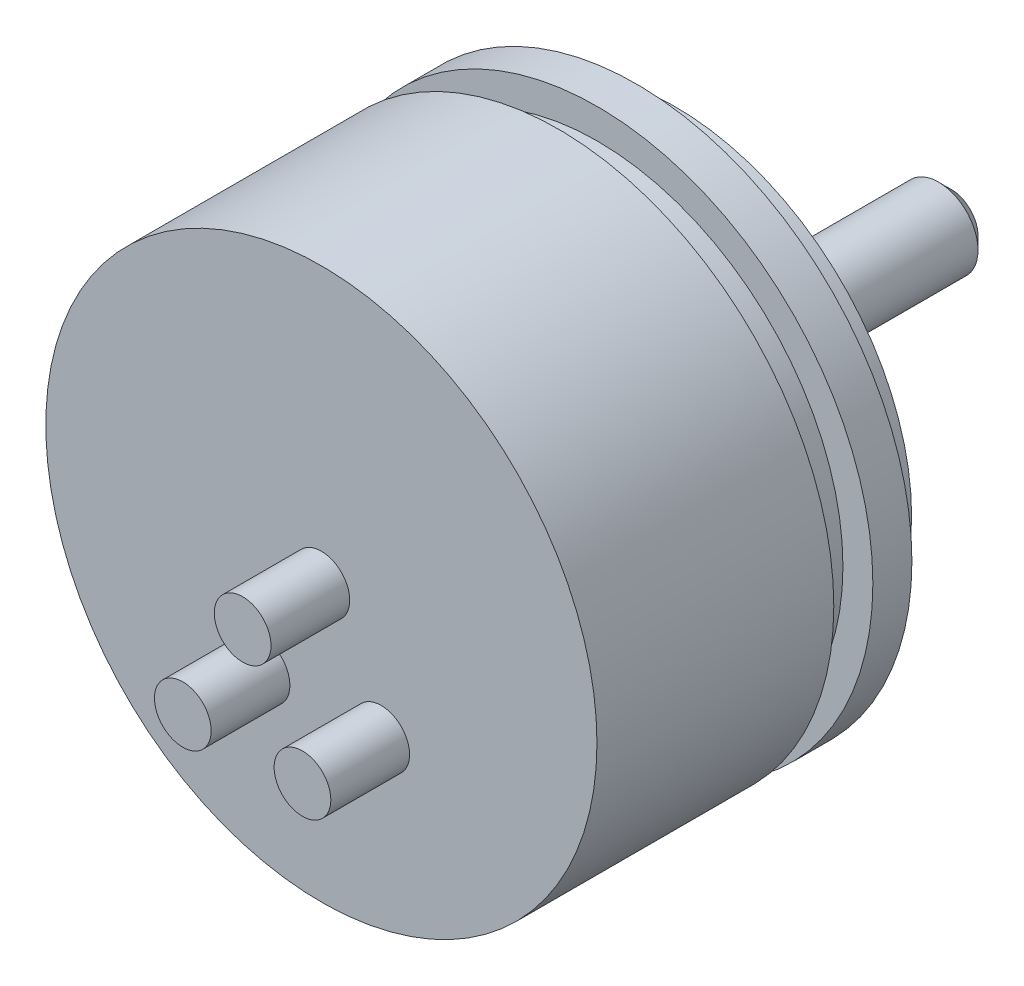
ISO-10303-21;
HEADER;
FILE_DESCRIPTION(('STEP AP214'),'2;1');
FILE_NAME('part.step','',(''),(''),'','','');
FILE_SCHEMA(('AUTOMOTIVE_DESIGN { 1 0 10303 214 1 1 1 1 }'));
ENDSEC;
DATA;
#1=APPLICATION_CONTEXT('core data for automotive mechanical design processes');
#2=APPLICATION_PROTOCOL_DEFINITION('international standard','automotive_design',2000,#1);
#3=PRODUCT_CONTEXT('',#1,'mechanical');
#4=PRODUCT('Part','Part','',(#3));
#5=PRODUCT_RELATED_PRODUCT_CATEGORY('part','',(#4));
#6=PRODUCT_DEFINITION_FORMATION('','',#4);
#7=PRODUCT_DEFINITION_CONTEXT('part definition',#1,'design');
#8=PRODUCT_DEFINITION('design','',#6,#7);
#9=PRODUCT_DEFINITION_SHAPE('','',#8);
#10=(LENGTH_UNIT() NAMED_UNIT(*) SI_UNIT(.MILLI.,.METRE.));
#11=(NAMED_UNIT(*) PLANE_ANGLE_UNIT() SI_UNIT($,.RADIAN.));
#12=(NAMED_UNIT(*) SI_UNIT($,.STERADIAN.) SOLID_ANGLE_UNIT());
#13=UNCERTAINTY_MEASURE_WITH_UNIT(LENGTH_MEASURE(1.E-05),#10,'distance_accuracy_value','');
#14=(GEOMETRIC_REPRESENTATION_CONTEXT(3) GLOBAL_UNCERTAINTY_ASSIGNED_CONTEXT((#13)) GLOBAL_UNIT_ASSIGNED_CONTEXT((#10,
#11,#12)) REPRESENTATION_CONTEXT('',''));
#15=CARTESIAN_POINT('',(0.,0.,0.));
#16=DIRECTION('',(0.,0.,1.));
#17=DIRECTION('',(1.,0.,0.));
#18=AXIS2_PLACEMENT_3D('',#15,#16,#17);
#19=CARTESIAN_POINT('',(0.,4.03612415627757,9.5504));
#20=DIRECTION('',(0.,0.,1.));
#21=DIRECTION('',(1.,0.,0.));
#22=AXIS2_PLACEMENT_3D('',#19,#20,#21);
#23=PLANE('',#22);
#24=CARTESIAN_POINT('',(-2.41299999999997,-4.17943859866372,9.5504));
#25=DIRECTION('',(0.,0.,1.));
#26=DIRECTION('',(1.,0.,0.));
#27=AXIS2_PLACEMENT_3D('',#24,#25,#26);
#28=CIRCLE('',#27,1.143);
#29=CARTESIAN_POINT('',(-1.26999999999997,-4.17943859866372,9.5504));
#30=VERTEX_POINT('',#29);
#31=EDGE_CURVE('E86',#30,#30,#28,.T.);
#32=ORIENTED_EDGE('',*,*,#31,.F.);
#33=EDGE_LOOP('',(#32));
#34=FACE_BOUND('',#33,.T.);
#35=CARTESIAN_POINT('',(0.,0.,9.5504));
#36=DIRECTION('',(0.,0.,1.));
#37=DIRECTION('',(1.,0.,0.));
#38=AXIS2_PLACEMENT_3D('',#35,#36,#37);
#39=CIRCLE('',#38,11.1125);
#40=CARTESIAN_POINT('',(11.1125,0.,9.5504));
#41=VERTEX_POINT('',#40);
#42=EDGE_CURVE('E76',#41,#41,#39,.T.);
#43=ORIENTED_EDGE('',*,*,#42,.T.);
#44=EDGE_LOOP('',(#43));
#45=FACE_BOUND('',#44,.T.);
#46=CARTESIAN_POINT('',(0.,0.,9.5504));
#47=DIRECTION('',(0.,0.,1.));
#48=DIRECTION('',(1.,0.,0.));
#49=AXIS2_PLACEMENT_3D('',#46,#47,#48);
#50=CIRCLE('',#49,1.143);
#51=CARTESIAN_POINT('',(1.143,0.,9.5504));
#52=VERTEX_POINT('',#51);
#53=EDGE_CURVE('E80',#52,#52,#50,.T.);
#54=ORIENTED_EDGE('',*,*,#53,.F.);
#55=EDGE_LOOP('',(#54));
#56=FACE_BOUND('',#55,.T.);
#57=CARTESIAN_POINT('',(2.41300000000004,-4.17943859866368,9.5504));
#58=DIRECTION('',(0.,0.,1.));
#59=DIRECTION('',(1.,0.,0.));
#60=AXIS2_PLACEMENT_3D('',#57,#58,#59);
#61=CIRCLE('',#60,1.143);
#62=CARTESIAN_POINT('',(3.55600000000004,-4.17943859866368,9.5504));
#63=VERTEX_POINT('',#62);
#64=EDGE_CURVE('E92',#63,#63,#61,.T.);
#65=ORIENTED_EDGE('',*,*,#64,.F.);
#66=EDGE_LOOP('',(#65));
#67=FACE_BOUND('',#66,.T.);
#68=ADVANCED_FACE('F33',(#34,#45,#56,#67),#23,.T.);
#69=CARTESIAN_POINT('',(0.,4.03612415627757,-15.8496));
#70=DIRECTION('',(0.,0.,-1.));
#71=DIRECTION('',(-1.,0.,0.));
#72=AXIS2_PLACEMENT_3D('',#69,#70,#71);
#73=PLANE('',#72);
#74=CARTESIAN_POINT('',(0.,0.,-15.8496));
#75=DIRECTION('',(0.,0.,1.));
#76=DIRECTION('',(1.,0.,0.));
#77=AXIS2_PLACEMENT_3D('',#74,#75,#76);
#78=CIRCLE('',#77,1.07696);
#79=CARTESIAN_POINT('',(1.07696,0.,-15.8496));
#80=VERTEX_POINT('',#79);
#81=EDGE_CURVE('E10',#80,#80,#78,.T.);
#82=ORIENTED_EDGE('',*,*,#81,.F.);
#83=EDGE_LOOP('',(#82));
#84=FACE_BOUND('',#83,.T.);
#85=ADVANCED_FACE('F108',(#84),#73,.T.);
#86=CARTESIAN_POINT('',(0.,0.,-15.3416));
#87=DIRECTION('',(0.,0.,1.));
#88=DIRECTION('',(1.,0.,0.));
#89=AXIS2_PLACEMENT_3D('',#86,#87,#88);
#90=CONICAL_SURFACE('',#89,1.58496,0.785398163397447);
#91=ORIENTED_EDGE('',*,*,#81,.T.);
#92=EDGE_LOOP('',(#91));
#93=FACE_BOUND('',#92,.T.);
#94=CARTESIAN_POINT('',(0.,0.,-15.3416));
#95=DIRECTION('',(0.,0.,1.));
#96=DIRECTION('',(1.,0.,0.));
#97=AXIS2_PLACEMENT_3D('',#94,#95,#96);
#98=CIRCLE('',#97,1.58496);
#99=CARTESIAN_POINT('',(1.58496,0.,-15.3416));
#100=VERTEX_POINT('',#99);
#101=EDGE_CURVE('E39',#100,#100,#98,.T.);
#102=ORIENTED_EDGE('',*,*,#101,.F.);
#103=EDGE_LOOP('',(#102));
#104=FACE_BOUND('',#103,.T.);
#105=ADVANCED_FACE('F113',(#93,#104),#90,.T.);
#106=CARTESIAN_POINT('',(0.,0.,28.0407999346046));
#107=DIRECTION('',(0.,0.,1.));
#108=DIRECTION('',(1.,0.,0.));
#109=AXIS2_PLACEMENT_3D('',#106,#107,#108);
#110=CYLINDRICAL_SURFACE('',#109,1.58496);
#111=ORIENTED_EDGE('',*,*,#101,.T.);
#112=EDGE_LOOP('',(#111));
#113=FACE_BOUND('',#112,.T.);
#114=CARTESIAN_POINT('',(0.,0.,-5.2324));
#115=DIRECTION('',(0.,0.,1.));
#116=DIRECTION('',(1.,0.,0.));
#117=AXIS2_PLACEMENT_3D('',#114,#115,#116);
#118=CIRCLE('',#117,1.58496);
#119=CARTESIAN_POINT('',(1.58496,0.,-5.2324));
#120=VERTEX_POINT('',#119);
#121=EDGE_CURVE('E43',#120,#120,#118,.T.);
#122=ORIENTED_EDGE('',*,*,#121,.F.);
#123=EDGE_LOOP('',(#122));
#124=FACE_BOUND('',#123,.T.);
#125=ADVANCED_FACE('F174',(#113,#124),#110,.T.);
#126=CARTESIAN_POINT('',(0.,4.03612415627757,-5.2324));
#127=DIRECTION('',(0.,0.,-1.));
#128=DIRECTION('',(-1.,0.,0.));
#129=AXIS2_PLACEMENT_3D('',#126,#127,#128);
#130=PLANE('',#129);
#131=ORIENTED_EDGE('',*,*,#121,.T.);
#132=EDGE_LOOP('',(#131));
#133=FACE_BOUND('',#132,.T.);
#134=CARTESIAN_POINT('',(0.,0.,-5.2324));
#135=DIRECTION('',(0.,0.,1.));
#136=DIRECTION('',(1.,0.,0.));
#137=AXIS2_PLACEMENT_3D('',#134,#135,#136);
#138=CIRCLE('',#137,1.83896);
#139=CARTESIAN_POINT('',(1.83896,0.,-5.2324));
#140=VERTEX_POINT('',#139);
#141=EDGE_CURVE('E47',#140,#140,#138,.T.);
#142=ORIENTED_EDGE('',*,*,#141,.F.);
#143=EDGE_LOOP('',(#142));
#144=FACE_BOUND('',#143,.T.);
#145=ADVANCED_FACE('F170',(#133,#144),#130,.T.);
#146=CARTESIAN_POINT('',(0.,0.,28.0407999346046));
#147=DIRECTION('',(0.,0.,1.));
#148=DIRECTION('',(1.,0.,0.));
#149=AXIS2_PLACEMENT_3D('',#146,#147,#148);
#150=CYLINDRICAL_SURFACE('',#149,1.83896);
#151=ORIENTED_EDGE('',*,*,#141,.T.);
#152=EDGE_LOOP('',(#151));
#153=FACE_BOUND('',#152,.T.);
#154=CARTESIAN_POINT('',(0.,0.,-4.7244));
#155=DIRECTION('',(0.,0.,1.));
#156=DIRECTION('',(1.,0.,0.));
#157=AXIS2_PLACEMENT_3D('',#154,#155,#156);
#158=CIRCLE('',#157,1.83896);
#159=CARTESIAN_POINT('',(1.83896,0.,-4.7244));
#160=VERTEX_POINT('',#159);
#161=EDGE_CURVE('E52',#160,#160,#158,.T.);
#162=ORIENTED_EDGE('',*,*,#161,.F.);
#163=EDGE_LOOP('',(#162));
#164=FACE_BOUND('',#163,.T.);
#165=ADVANCED_FACE('F166',(#153,#164),#150,.T.);
#166=CARTESIAN_POINT('',(0.,4.03612415627757,-4.7244));
#167=DIRECTION('',(0.,0.,-1.));
#168=DIRECTION('',(-1.,0.,0.));
#169=AXIS2_PLACEMENT_3D('',#166,#167,#168);
#170=PLANE('',#169);
#171=ORIENTED_EDGE('',*,*,#161,.T.);
#172=EDGE_LOOP('',(#171));
#173=FACE_BOUND('',#172,.T.);
#174=CARTESIAN_POINT('',(0.,0.,-4.7244));
#175=DIRECTION('',(0.,0.,1.));
#176=DIRECTION('',(1.,0.,0.));
#177=AXIS2_PLACEMENT_3D('',#174,#175,#176);
#178=CIRCLE('',#177,9.525);
#179=CARTESIAN_POINT('',(9.525,0.,-4.7244));
#180=VERTEX_POINT('',#179);
#181=EDGE_CURVE('E55',#180,#180,#178,.T.);
#182=ORIENTED_EDGE('',*,*,#181,.F.);
#183=EDGE_LOOP('',(#182));
#184=FACE_BOUND('',#183,.T.);
#185=ADVANCED_FACE('F162',(#173,#184),#170,.T.);
#186=CARTESIAN_POINT('',(0.,0.,28.0407999346046));
#187=DIRECTION('',(0.,0.,1.));
#188=DIRECTION('',(1.,0.,0.));
#189=AXIS2_PLACEMENT_3D('',#186,#187,#188);
#190=CYLINDRICAL_SURFACE('',#189,9.525);
#191=ORIENTED_EDGE('',*,*,#181,.T.);
#192=EDGE_LOOP('',(#191));
#193=FACE_BOUND('',#192,.T.);
#194=CARTESIAN_POINT('',(0.,0.,-3.1496));
#195=DIRECTION('',(0.,0.,1.));
#196=DIRECTION('',(1.,0.,0.));
#197=AXIS2_PLACEMENT_3D('',#194,#195,#196);
#198=CIRCLE('',#197,9.525);
#199=CARTESIAN_POINT('',(9.525,0.,-3.1496));
#200=VERTEX_POINT('',#199);
#201=EDGE_CURVE('E58',#200,#200,#198,.T.);
#202=ORIENTED_EDGE('',*,*,#201,.F.);
#203=EDGE_LOOP('',(#202));
#204=FACE_BOUND('',#203,.T.);
#205=ADVANCED_FACE('F158',(#193,#204),#190,.T.);
#206=CARTESIAN_POINT('',(0.,4.03612415627757,-3.1496));
#207=DIRECTION('',(0.,0.,-1.));
#208=DIRECTION('',(-1.,0.,0.));
#209=AXIS2_PLACEMENT_3D('',#206,#207,#208);
#210=PLANE('',#209);
#211=ORIENTED_EDGE('',*,*,#201,.T.);
#212=EDGE_LOOP('',(#211));
#213=FACE_BOUND('',#212,.T.);
#214=CARTESIAN_POINT('',(0.,0.,-3.1496));
#215=DIRECTION('',(0.,0.,1.));
#216=DIRECTION('',(1.,0.,0.));
#217=AXIS2_PLACEMENT_3D('',#214,#215,#216);
#218=CIRCLE('',#217,11.1125);
#219=CARTESIAN_POINT('',(11.1125,0.,-3.1496));
#220=VERTEX_POINT('',#219);
#221=EDGE_CURVE('E61',#220,#220,#218,.T.);
#222=ORIENTED_EDGE('',*,*,#221,.F.);
#223=EDGE_LOOP('',(#222));
#224=FACE_BOUND('',#223,.T.);
#225=ADVANCED_FACE('F154',(#213,#224),#210,.T.);
#226=CARTESIAN_POINT('',(0.,0.,28.0407999346046));
#227=DIRECTION('',(0.,0.,1.));
#228=DIRECTION('',(1.,0.,0.));
#229=AXIS2_PLACEMENT_3D('',#226,#227,#228);
#230=CYLINDRICAL_SURFACE('',#229,11.1125);
#231=ORIENTED_EDGE('',*,*,#221,.T.);
#232=EDGE_LOOP('',(#231));
#233=FACE_BOUND('',#232,.T.);
#234=CARTESIAN_POINT('',(0.,0.,-1.5748));
#235=DIRECTION('',(0.,0.,1.));
#236=DIRECTION('',(1.,0.,0.));
#237=AXIS2_PLACEMENT_3D('',#234,#235,#236);
#238=CIRCLE('',#237,11.1125);
#239=CARTESIAN_POINT('',(11.1125,0.,-1.5748));
#240=VERTEX_POINT('',#239);
#241=EDGE_CURVE('E64',#240,#240,#238,.T.);
#242=ORIENTED_EDGE('',*,*,#241,.F.);
#243=EDGE_LOOP('',(#242));
#244=FACE_BOUND('',#243,.T.);
#245=ADVANCED_FACE('F150',(#233,#244),#230,.T.);
#246=CARTESIAN_POINT('',(0.,4.03612415627757,-1.5748));
#247=DIRECTION('',(0.,0.,1.));
#248=DIRECTION('',(1.,0.,0.));
#249=AXIS2_PLACEMENT_3D('',#246,#247,#248);
#250=PLANE('',#249);
#251=ORIENTED_EDGE('',*,*,#241,.T.);
#252=EDGE_LOOP('',(#251));
#253=FACE_BOUND('',#252,.T.);
#254=CARTESIAN_POINT('',(0.,0.,-1.5748));
#255=DIRECTION('',(0.,0.,1.));
#256=DIRECTION('',(1.,0.,0.));
#257=AXIS2_PLACEMENT_3D('',#254,#255,#256);
#258=CIRCLE('',#257,9.906);
#259=CARTESIAN_POINT('',(9.906,0.,-1.5748));
#260=VERTEX_POINT('',#259);
#261=EDGE_CURVE('E67',#260,#260,#258,.T.);
#262=ORIENTED_EDGE('',*,*,#261,.F.);
#263=EDGE_LOOP('',(#262));
#264=FACE_BOUND('',#263,.T.);
#265=ADVANCED_FACE('F146',(#253,#264),#250,.T.);
#266=CARTESIAN_POINT('',(0.,0.,28.0407999346046));
#267=DIRECTION('',(0.,0.,1.));
#268=DIRECTION('',(1.,0.,0.));
#269=AXIS2_PLACEMENT_3D('',#266,#267,#268);
#270=CYLINDRICAL_SURFACE('',#269,9.906);
#271=ORIENTED_EDGE('',*,*,#261,.T.);
#272=EDGE_LOOP('',(#271));
#273=FACE_BOUND('',#272,.T.);
#274=CARTESIAN_POINT('',(0.,0.,0.));
#275=DIRECTION('',(0.,0.,1.));
#276=DIRECTION('',(1.,0.,0.));
#277=AXIS2_PLACEMENT_3D('',#274,#275,#276);
#278=CIRCLE('',#277,9.906);
#279=CARTESIAN_POINT('',(9.906,0.,0.));
#280=VERTEX_POINT('',#279);
#281=EDGE_CURVE('E70',#280,#280,#278,.T.);
#282=ORIENTED_EDGE('',*,*,#281,.F.);
#283=EDGE_LOOP('',(#282));
#284=FACE_BOUND('',#283,.T.);
#285=ADVANCED_FACE('F142',(#273,#284),#270,.T.);
#286=CARTESIAN_POINT('',(0.,4.03612415627757,0.));
#287=DIRECTION('',(0.,0.,-1.));
#288=DIRECTION('',(-1.,0.,0.));
#289=AXIS2_PLACEMENT_3D('',#286,#287,#288);
#290=PLANE('',#289);
#291=ORIENTED_EDGE('',*,*,#281,.T.);
#292=EDGE_LOOP('',(#291));
#293=FACE_BOUND('',#292,.T.);
#294=CARTESIAN_POINT('',(0.,0.,0.));
#295=DIRECTION('',(0.,0.,1.));
#296=DIRECTION('',(1.,0.,0.));
#297=AXIS2_PLACEMENT_3D('',#294,#295,#296);
#298=CIRCLE('',#297,11.1125);
#299=CARTESIAN_POINT('',(11.1125,0.,0.));
#300=VERTEX_POINT('',#299);
#301=EDGE_CURVE('E73',#300,#300,#298,.T.);
#302=ORIENTED_EDGE('',*,*,#301,.F.);
#303=EDGE_LOOP('',(#302));
#304=FACE_BOUND('',#303,.T.);
#305=ADVANCED_FACE('F134',(#293,#304),#290,.T.);
#306=CARTESIAN_POINT('',(0.,0.,28.0407999346046));
#307=DIRECTION('',(0.,0.,1.));
#308=DIRECTION('',(1.,0.,0.));
#309=AXIS2_PLACEMENT_3D('',#306,#307,#308);
#310=CYLINDRICAL_SURFACE('',#309,11.1125);
#311=ORIENTED_EDGE('',*,*,#301,.T.);
#312=EDGE_LOOP('',(#311));
#313=FACE_BOUND('',#312,.T.);
#314=ORIENTED_EDGE('',*,*,#42,.F.);
#315=EDGE_LOOP('',(#314));
#316=FACE_BOUND('',#315,.T.);
#317=ADVANCED_FACE('F124',(#313,#316),#310,.T.);
#318=CARTESIAN_POINT('',(0.,0.,12.7254));
#319=DIRECTION('',(0.,0.,-1.));
#320=DIRECTION('',(-1.,0.,0.));
#321=AXIS2_PLACEMENT_3D('',#318,#319,#320);
#322=CYLINDRICAL_SURFACE('',#321,1.143);
#323=CARTESIAN_POINT('',(0.,0.,12.7254));
#324=DIRECTION('',(0.,0.,1.));
#325=DIRECTION('',(1.,0.,0.));
#326=AXIS2_PLACEMENT_3D('',#323,#324,#325);
#327=CIRCLE('',#326,1.143);
#328=CARTESIAN_POINT('',(1.143,0.,12.7254));
#329=VERTEX_POINT('',#328);
#330=EDGE_CURVE('E79',#329,#329,#327,.T.);
#331=ORIENTED_EDGE('',*,*,#330,.F.);
#332=EDGE_LOOP('',(#331));
#333=FACE_BOUND('',#332,.T.);
#334=ORIENTED_EDGE('',*,*,#53,.T.);
#335=EDGE_LOOP('',(#334));
#336=FACE_BOUND('',#335,.T.);
#337=ADVANCED_FACE('F121',(#333,#336),#322,.T.);
#338=CARTESIAN_POINT('',(0.,0.,12.7254));
#339=DIRECTION('',(0.,0.,1.));
#340=DIRECTION('',(1.,0.,0.));
#341=AXIS2_PLACEMENT_3D('',#338,#339,#340);
#342=PLANE('',#341);
#343=ORIENTED_EDGE('',*,*,#330,.T.);
#344=EDGE_LOOP('',(#343));
#345=FACE_BOUND('',#344,.T.);
#346=ADVANCED_FACE('F123',(#345),#342,.T.);
#347=CARTESIAN_POINT('',(-2.41299999999997,-4.17943859866372,12.7254));
#348=DIRECTION('',(0.,0.,-1.));
#349=DIRECTION('',(-1.,0.,0.));
#350=AXIS2_PLACEMENT_3D('',#347,#348,#349);
#351=CYLINDRICAL_SURFACE('',#350,1.143);
#352=CARTESIAN_POINT('',(-2.41299999999997,-4.17943859866372,12.7254));
#353=DIRECTION('',(0.,0.,1.));
#354=DIRECTION('',(1.,0.,0.));
#355=AXIS2_PLACEMENT_3D('',#352,#353,#354);
#356=CIRCLE('',#355,1.143);
#357=CARTESIAN_POINT('',(-1.26999999999997,-4.17943859866372,12.7254));
#358=VERTEX_POINT('',#357);
#359=EDGE_CURVE('E83',#358,#358,#356,.T.);
#360=ORIENTED_EDGE('',*,*,#359,.F.);
#361=EDGE_LOOP('',(#360));
#362=FACE_BOUND('',#361,.T.);
#363=ORIENTED_EDGE('',*,*,#31,.T.);
#364=EDGE_LOOP('',(#363));
#365=FACE_BOUND('',#364,.T.);
#366=ADVANCED_FACE('F131',(#362,#365),#351,.T.);
#367=CARTESIAN_POINT('',(-2.41299999999997,-4.17943859866372,12.7254));
#368=DIRECTION('',(0.,0.,1.));
#369=DIRECTION('',(1.,0.,0.));
#370=AXIS2_PLACEMENT_3D('',#367,#368,#369);
#371=PLANE('',#370);
#372=ORIENTED_EDGE('',*,*,#359,.T.);
#373=EDGE_LOOP('',(#372));
#374=FACE_BOUND('',#373,.T.);
#375=ADVANCED_FACE('F103',(#374),#371,.T.);
#376=CARTESIAN_POINT('',(2.41300000000004,-4.17943859866368,12.7254));
#377=DIRECTION('',(0.,0.,-1.));
#378=DIRECTION('',(-1.,0.,0.));
#379=AXIS2_PLACEMENT_3D('',#376,#377,#378);
#380=CYLINDRICAL_SURFACE('',#379,1.143);
#381=CARTESIAN_POINT('',(2.41300000000004,-4.17943859866368,12.7254));
#382=DIRECTION('',(0.,0.,1.));
#383=DIRECTION('',(1.,0.,0.));
#384=AXIS2_PLACEMENT_3D('',#381,#382,#383);
#385=CIRCLE('',#384,1.143);
#386=CARTESIAN_POINT('',(3.55600000000004,-4.17943859866368,12.7254));
#387=VERTEX_POINT('',#386);
#388=EDGE_CURVE('E89',#387,#387,#385,.T.);
#389=ORIENTED_EDGE('',*,*,#388,.F.);
#390=EDGE_LOOP('',(#389));
#391=FACE_BOUND('',#390,.T.);
#392=ORIENTED_EDGE('',*,*,#64,.T.);
#393=EDGE_LOOP('',(#392));
#394=FACE_BOUND('',#393,.T.);
#395=ADVANCED_FACE('F100',(#391,#394),#380,.T.);
#396=CARTESIAN_POINT('',(2.41300000000004,-4.17943859866368,12.7254));
#397=DIRECTION('',(0.,0.,1.));
#398=DIRECTION('',(1.,0.,0.));
#399=AXIS2_PLACEMENT_3D('',#396,#397,#398);
#400=PLANE('',#399);
#401=ORIENTED_EDGE('',*,*,#388,.T.);
#402=EDGE_LOOP('',(#401));
#403=FACE_BOUND('',#402,.T.);
#404=ADVANCED_FACE('F98',(#403),#400,.T.);
#405=CLOSED_SHELL('',(#68,#85,#105,#125,#145,#165,#185,#205,#225,#245,#265,#285,#305,#317,#337,
#346,#366,#375,#395,#404));
#406=MANIFOLD_SOLID_BREP('B2',#405);
#407=ADVANCED_BREP_SHAPE_REPRESENTATION('',(#18,#406),#14);
#408=SHAPE_DEFINITION_REPRESENTATION(#9,#407);
ENDSEC;
END-ISO-10303-21;
